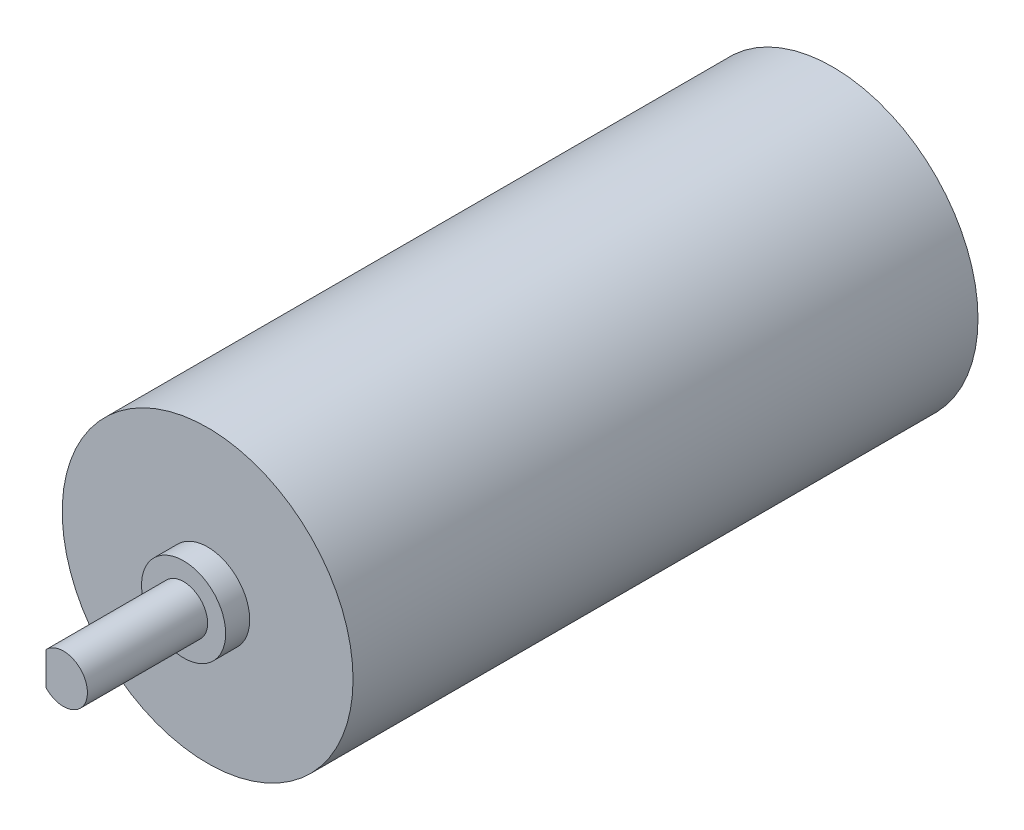
ISO-10303-21;
HEADER;
FILE_DESCRIPTION(('STEP AP214'),'2;1');
FILE_NAME('part.step','',(''),(''),'','','');
FILE_SCHEMA(('AUTOMOTIVE_DESIGN { 1 0 10303 214 1 1 1 1 }'));
ENDSEC;
DATA;
#1=APPLICATION_CONTEXT('core data for automotive mechanical design processes');
#2=APPLICATION_PROTOCOL_DEFINITION('international standard','automotive_design',2000,#1);
#3=PRODUCT_CONTEXT('',#1,'mechanical');
#4=PRODUCT('Part','Part','',(#3));
#5=PRODUCT_RELATED_PRODUCT_CATEGORY('part','',(#4));
#6=PRODUCT_DEFINITION_FORMATION('','',#4);
#7=PRODUCT_DEFINITION_CONTEXT('part definition',#1,'design');
#8=PRODUCT_DEFINITION('design','',#6,#7);
#9=PRODUCT_DEFINITION_SHAPE('','',#8);
#10=(LENGTH_UNIT() NAMED_UNIT(*) SI_UNIT(.MILLI.,.METRE.));
#11=(NAMED_UNIT(*) PLANE_ANGLE_UNIT() SI_UNIT($,.RADIAN.));
#12=(NAMED_UNIT(*) SI_UNIT($,.STERADIAN.) SOLID_ANGLE_UNIT());
#13=UNCERTAINTY_MEASURE_WITH_UNIT(LENGTH_MEASURE(1.E-05),#10,'distance_accuracy_value','');
#14=(GEOMETRIC_REPRESENTATION_CONTEXT(3) GLOBAL_UNCERTAINTY_ASSIGNED_CONTEXT((#13)) GLOBAL_UNIT_ASSIGNED_CONTEXT((#10,
#11,#12)) REPRESENTATION_CONTEXT('',''));
#15=CARTESIAN_POINT('',(0.,0.,0.));
#16=DIRECTION('',(0.,0.,1.));
#17=DIRECTION('',(1.,0.,0.));
#18=AXIS2_PLACEMENT_3D('',#15,#16,#17);
#19=CARTESIAN_POINT('',(0.,0.,52.));
#20=DIRECTION('',(0.,0.,-1.));
#21=DIRECTION('',(-1.,0.,0.));
#22=AXIS2_PLACEMENT_3D('',#19,#20,#21);
#23=CYLINDRICAL_SURFACE('',#22,12.1);
#24=CARTESIAN_POINT('',(0.,0.,52.));
#25=DIRECTION('',(0.,0.,1.));
#26=DIRECTION('',(1.,0.,0.));
#27=AXIS2_PLACEMENT_3D('',#24,#25,#26);
#28=CIRCLE('',#27,12.1);
#29=CARTESIAN_POINT('',(12.1,0.,52.));
#30=VERTEX_POINT('',#29);
#31=EDGE_CURVE('E47',#30,#30,#28,.T.);
#32=ORIENTED_EDGE('',*,*,#31,.F.);
#33=EDGE_LOOP('',(#32));
#34=FACE_BOUND('',#33,.T.);
#35=CARTESIAN_POINT('',(0.,0.,0.));
#36=DIRECTION('',(0.,0.,1.));
#37=DIRECTION('',(1.,0.,0.));
#38=AXIS2_PLACEMENT_3D('',#35,#36,#37);
#39=CIRCLE('',#38,12.1);
#40=CARTESIAN_POINT('',(12.1,0.,0.));
#41=VERTEX_POINT('',#40);
#42=EDGE_CURVE('E42',#41,#41,#39,.T.);
#43=ORIENTED_EDGE('',*,*,#42,.T.);
#44=EDGE_LOOP('',(#43));
#45=FACE_BOUND('',#44,.T.);
#46=ADVANCED_FACE('F39',(#34,#45),#23,.T.);
#47=CARTESIAN_POINT('',(0.,0.,52.));
#48=DIRECTION('',(0.,0.,1.));
#49=DIRECTION('',(1.,0.,0.));
#50=AXIS2_PLACEMENT_3D('',#47,#48,#49);
#51=PLANE('',#50);
#52=CARTESIAN_POINT('',(0.,0.,52.));
#53=DIRECTION('',(0.,0.,1.));
#54=DIRECTION('',(1.,0.,0.));
#55=AXIS2_PLACEMENT_3D('',#52,#53,#54);
#56=CIRCLE('',#55,3.5);
#57=CARTESIAN_POINT('',(3.5,0.,52.));
#58=VERTEX_POINT('',#57);
#59=EDGE_CURVE('E11',#58,#58,#56,.T.);
#60=ORIENTED_EDGE('',*,*,#59,.F.);
#61=EDGE_LOOP('',(#60));
#62=FACE_BOUND('',#61,.T.);
#63=ORIENTED_EDGE('',*,*,#31,.T.);
#64=EDGE_LOOP('',(#63));
#65=FACE_BOUND('',#64,.T.);
#66=ADVANCED_FACE('F98',(#62,#65),#51,.T.);
#67=CARTESIAN_POINT('',(0.,0.,0.));
#68=DIRECTION('',(0.,0.,1.));
#69=DIRECTION('',(1.,0.,0.));
#70=AXIS2_PLACEMENT_3D('',#67,#68,#69);
#71=PLANE('',#70);
#72=ORIENTED_EDGE('',*,*,#42,.F.);
#73=EDGE_LOOP('',(#72));
#74=FACE_BOUND('',#73,.T.);
#75=ADVANCED_FACE('F95',(#74),#71,.F.);
#76=CARTESIAN_POINT('',(0.,0.,54.));
#77=DIRECTION('',(0.,0.,-1.));
#78=DIRECTION('',(-1.,0.,0.));
#79=AXIS2_PLACEMENT_3D('',#76,#77,#78);
#80=CYLINDRICAL_SURFACE('',#79,3.5);
#81=CARTESIAN_POINT('',(0.,0.,54.));
#82=DIRECTION('',(0.,0.,1.));
#83=DIRECTION('',(1.,0.,0.));
#84=AXIS2_PLACEMENT_3D('',#81,#82,#83);
#85=CIRCLE('',#84,3.5);
#86=CARTESIAN_POINT('',(3.5,0.,54.));
#87=VERTEX_POINT('',#86);
#88=EDGE_CURVE('E83',#87,#87,#85,.T.);
#89=ORIENTED_EDGE('',*,*,#88,.F.);
#90=EDGE_LOOP('',(#89));
#91=FACE_BOUND('',#90,.T.);
#92=ORIENTED_EDGE('',*,*,#59,.T.);
#93=EDGE_LOOP('',(#92));
#94=FACE_BOUND('',#93,.T.);
#95=ADVANCED_FACE('F97',(#91,#94),#80,.T.);
#96=CARTESIAN_POINT('',(0.,0.,54.));
#97=DIRECTION('',(0.,0.,1.));
#98=DIRECTION('',(1.,0.,0.));
#99=AXIS2_PLACEMENT_3D('',#96,#97,#98);
#100=PLANE('',#99);
#101=CARTESIAN_POINT('',(0.,0.,54.));
#102=DIRECTION('',(0.,0.,1.));
#103=DIRECTION('',(1.,0.,0.));
#104=AXIS2_PLACEMENT_3D('',#101,#102,#103);
#105=CIRCLE('',#104,2.);
#106=CARTESIAN_POINT('',(-1.44934759223624,-1.37818415201997,54.));
#107=VERTEX_POINT('',#106);
#108=CARTESIAN_POINT('',(-1.44934759223624,1.37818415201997,54.));
#109=VERTEX_POINT('',#108);
#110=EDGE_CURVE('E67',#107,#109,#105,.T.);
#111=ORIENTED_EDGE('',*,*,#110,.F.);
#112=DIRECTION('',(0.,-1.,0.));
#113=VECTOR('',#112,1.);
#114=CARTESIAN_POINT('',(-1.44934759223624,1.37818415201997,54.));
#115=LINE('',#114,#113);
#116=EDGE_CURVE('E54',#109,#107,#115,.T.);
#117=ORIENTED_EDGE('',*,*,#116,.F.);
#118=EDGE_LOOP('',(#111,#117));
#119=FACE_BOUND('',#118,.T.);
#120=ORIENTED_EDGE('',*,*,#88,.T.);
#121=EDGE_LOOP('',(#120));
#122=FACE_BOUND('',#121,.T.);
#123=ADVANCED_FACE('F68',(#119,#122),#100,.T.);
#124=CARTESIAN_POINT('',(0.,0.,64.));
#125=DIRECTION('',(0.,0.,-1.));
#126=DIRECTION('',(-1.,0.,0.));
#127=AXIS2_PLACEMENT_3D('',#124,#125,#126);
#128=CYLINDRICAL_SURFACE('',#127,2.);
#129=ORIENTED_EDGE('',*,*,#110,.T.);
#130=DIRECTION('',(0.,0.,-1.));
#131=VECTOR('',#130,1.);
#132=CARTESIAN_POINT('',(-1.44934759223624,1.37818415201997,64.));
#133=LINE('',#132,#131);
#134=CARTESIAN_POINT('',(-1.44934759223624,1.37818415201997,64.));
#135=VERTEX_POINT('',#134);
#136=EDGE_CURVE('E78',#135,#109,#133,.T.);
#137=ORIENTED_EDGE('',*,*,#136,.F.);
#138=CARTESIAN_POINT('',(0.,0.,64.));
#139=DIRECTION('',(0.,0.,1.));
#140=DIRECTION('',(1.,0.,0.));
#141=AXIS2_PLACEMENT_3D('',#138,#139,#140);
#142=CIRCLE('',#141,2.);
#143=CARTESIAN_POINT('',(-1.44934759223624,-1.37818415201997,64.));
#144=VERTEX_POINT('',#143);
#145=EDGE_CURVE('E79',#144,#135,#142,.T.);
#146=ORIENTED_EDGE('',*,*,#145,.F.);
#147=DIRECTION('',(0.,0.,-1.));
#148=VECTOR('',#147,1.);
#149=CARTESIAN_POINT('',(-1.44934759223624,-1.37818415201997,64.));
#150=LINE('',#149,#148);
#151=EDGE_CURVE('E76',#144,#107,#150,.T.);
#152=ORIENTED_EDGE('',*,*,#151,.T.);
#153=EDGE_LOOP('',(#129,#137,#146,#152));
#154=FACE_BOUND('',#153,.T.);
#155=ADVANCED_FACE('F81',(#154),#128,.T.);
#156=CARTESIAN_POINT('',(-1.44934759223624,1.37818415201997,64.));
#157=DIRECTION('',(1.,0.,0.));
#158=DIRECTION('',(0.,0.,-1.));
#159=AXIS2_PLACEMENT_3D('',#156,#157,#158);
#160=PLANE('',#159);
#161=ORIENTED_EDGE('',*,*,#116,.T.);
#162=ORIENTED_EDGE('',*,*,#151,.F.);
#163=DIRECTION('',(0.,-1.,0.));
#164=VECTOR('',#163,1.);
#165=CARTESIAN_POINT('',(-1.44934759223624,1.37818415201997,64.));
#166=LINE('',#165,#164);
#167=EDGE_CURVE('E62',#135,#144,#166,.T.);
#168=ORIENTED_EDGE('',*,*,#167,.F.);
#169=ORIENTED_EDGE('',*,*,#136,.T.);
#170=EDGE_LOOP('',(#161,#162,#168,#169));
#171=FACE_BOUND('',#170,.T.);
#172=ADVANCED_FACE('F75',(#171),#160,.F.);
#173=CARTESIAN_POINT('',(0.,0.,64.));
#174=DIRECTION('',(0.,0.,1.));
#175=DIRECTION('',(1.,0.,0.));
#176=AXIS2_PLACEMENT_3D('',#173,#174,#175);
#177=PLANE('',#176);
#178=ORIENTED_EDGE('',*,*,#145,.T.);
#179=ORIENTED_EDGE('',*,*,#167,.T.);
#180=EDGE_LOOP('',(#178,#179));
#181=FACE_BOUND('',#180,.T.);
#182=ADVANCED_FACE('F148',(#181),#177,.T.);
#183=CLOSED_SHELL('',(#46,#66,#75,#95,#123,#155,#172,#182));
#184=MANIFOLD_SOLID_BREP('B2',#183);
#185=ADVANCED_BREP_SHAPE_REPRESENTATION('',(#18,#184),#14);
#186=SHAPE_DEFINITION_REPRESENTATION(#9,#185);
ENDSEC;
END-ISO-10303-21;
